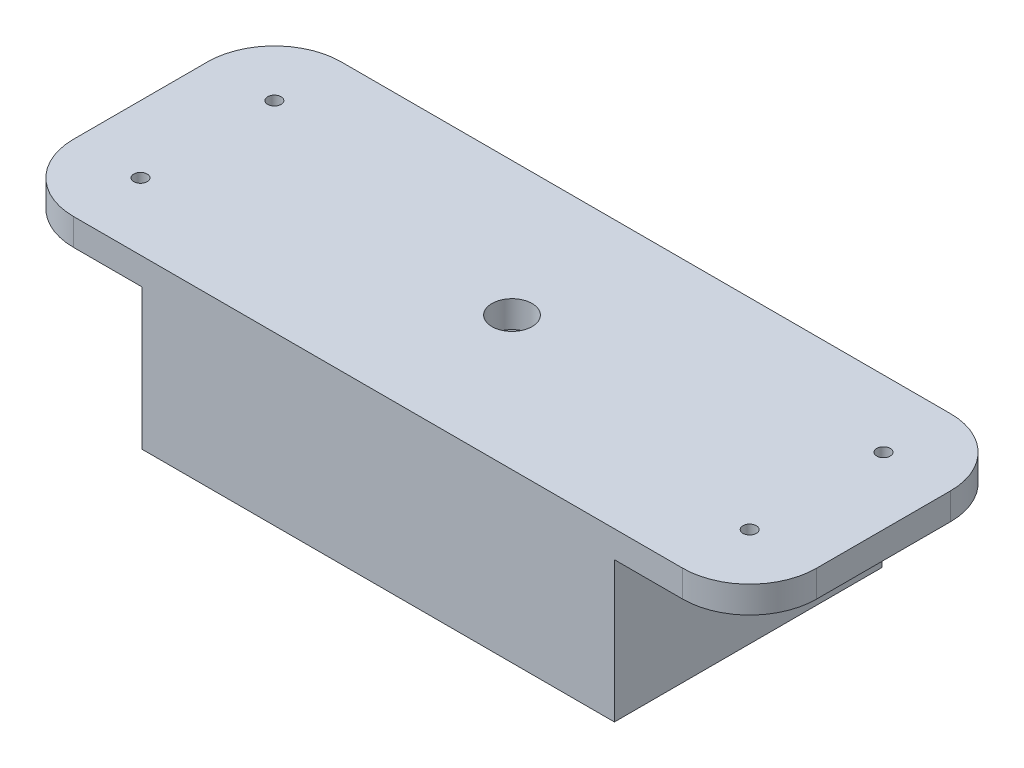
ISO-10303-21;
HEADER;
FILE_DESCRIPTION(('STEP AP214'),'2;1');
FILE_NAME('part.step','',(''),(''),'','','');
FILE_SCHEMA(('AUTOMOTIVE_DESIGN { 1 0 10303 214 1 1 1 1 }'));
ENDSEC;
DATA;
#1=APPLICATION_CONTEXT('core data for automotive mechanical design processes');
#2=APPLICATION_PROTOCOL_DEFINITION('international standard','automotive_design',2000,#1);
#3=PRODUCT_CONTEXT('',#1,'mechanical');
#4=PRODUCT('Part','Part','',(#3));
#5=PRODUCT_RELATED_PRODUCT_CATEGORY('part','',(#4));
#6=PRODUCT_DEFINITION_FORMATION('','',#4);
#7=PRODUCT_DEFINITION_CONTEXT('part definition',#1,'design');
#8=PRODUCT_DEFINITION('design','',#6,#7);
#9=PRODUCT_DEFINITION_SHAPE('','',#8);
#10=(LENGTH_UNIT() NAMED_UNIT(*) SI_UNIT(.MILLI.,.METRE.));
#11=(NAMED_UNIT(*) PLANE_ANGLE_UNIT() SI_UNIT($,.RADIAN.));
#12=(NAMED_UNIT(*) SI_UNIT($,.STERADIAN.) SOLID_ANGLE_UNIT());
#13=UNCERTAINTY_MEASURE_WITH_UNIT(LENGTH_MEASURE(1.E-05),#10,'distance_accuracy_value','');
#14=(GEOMETRIC_REPRESENTATION_CONTEXT(3) GLOBAL_UNCERTAINTY_ASSIGNED_CONTEXT((#13)) GLOBAL_UNIT_ASSIGNED_CONTEXT((#10,
#11,#12)) REPRESENTATION_CONTEXT('',''));
#15=CARTESIAN_POINT('',(0.,0.,0.));
#16=DIRECTION('',(0.,0.,1.));
#17=DIRECTION('',(1.,0.,0.));
#18=AXIS2_PLACEMENT_3D('',#15,#16,#17);
#19=CARTESIAN_POINT('',(0.,0.,0.));
#20=DIRECTION('',(0.,1.,0.));
#21=DIRECTION('',(0.,0.,1.));
#22=AXIS2_PLACEMENT_3D('',#19,#20,#21);
#23=PLANE('',#22);
#24=CARTESIAN_POINT('',(45.5,0.,-10.));
#25=DIRECTION('',(0.,1.,0.));
#26=DIRECTION('',(0.,0.,1.));
#27=AXIS2_PLACEMENT_3D('',#24,#25,#26);
#28=CIRCLE('',#27,0.999999999999998);
#29=CARTESIAN_POINT('',(45.5,0.,-9.));
#30=VERTEX_POINT('',#29);
#31=EDGE_CURVE('E247',#30,#30,#28,.T.);
#32=ORIENTED_EDGE('',*,*,#31,.T.);
#33=EDGE_LOOP('',(#32));
#34=FACE_BOUND('',#33,.T.);
#35=CARTESIAN_POINT('',(45.5,0.,10.));
#36=DIRECTION('',(0.,1.,0.));
#37=DIRECTION('',(0.,0.,1.));
#38=AXIS2_PLACEMENT_3D('',#35,#36,#37);
#39=CIRCLE('',#38,0.999999999999998);
#40=CARTESIAN_POINT('',(45.5,0.,11.));
#41=VERTEX_POINT('',#40);
#42=EDGE_CURVE('E199',#41,#41,#39,.T.);
#43=ORIENTED_EDGE('',*,*,#42,.T.);
#44=EDGE_LOOP('',(#43));
#45=FACE_BOUND('',#44,.T.);
#46=DIRECTION('',(0.,0.,1.));
#47=VECTOR('',#46,1.);
#48=CARTESIAN_POINT('',(35.3,0.,0.));
#49=LINE('',#48,#47);
#50=CARTESIAN_POINT('',(35.3,0.,-20.));
#51=VERTEX_POINT('',#50);
#52=CARTESIAN_POINT('',(35.3,0.,20.));
#53=VERTEX_POINT('',#52);
#54=EDGE_CURVE('E52',#51,#53,#49,.T.);
#55=ORIENTED_EDGE('',*,*,#54,.F.);
#56=DIRECTION('',(1.,0.,0.));
#57=VECTOR('',#56,1.);
#58=CARTESIAN_POINT('',(0.,0.,-20.));
#59=LINE('',#58,#57);
#60=CARTESIAN_POINT('',(45.4999999999999,0.,-20.));
#61=VERTEX_POINT('',#60);
#62=EDGE_CURVE('E253',#51,#61,#59,.T.);
#63=ORIENTED_EDGE('',*,*,#62,.T.);
#64=CARTESIAN_POINT('',(45.5,0.,-10.));
#65=DIRECTION('',(0.,1.,0.));
#66=DIRECTION('',(0.,0.,1.));
#67=AXIS2_PLACEMENT_3D('',#64,#65,#66);
#68=CIRCLE('',#67,10.);
#69=CARTESIAN_POINT('',(55.5,0.,-9.99999999999993));
#70=VERTEX_POINT('',#69);
#71=EDGE_CURVE('E250',#61,#70,#68,.F.);
#72=ORIENTED_EDGE('',*,*,#71,.T.);
#73=DIRECTION('',(0.,0.,1.));
#74=VECTOR('',#73,1.);
#75=CARTESIAN_POINT('',(55.5,0.,0.));
#76=LINE('',#75,#74);
#77=CARTESIAN_POINT('',(55.5,0.,9.99999999999993));
#78=VERTEX_POINT('',#77);
#79=EDGE_CURVE('E273',#70,#78,#76,.T.);
#80=ORIENTED_EDGE('',*,*,#79,.T.);
#81=CARTESIAN_POINT('',(45.5,0.,10.));
#82=DIRECTION('',(0.,1.,0.));
#83=DIRECTION('',(0.,0.,1.));
#84=AXIS2_PLACEMENT_3D('',#81,#82,#83);
#85=CIRCLE('',#84,10.);
#86=CARTESIAN_POINT('',(45.4999999999999,0.,20.));
#87=VERTEX_POINT('',#86);
#88=EDGE_CURVE('E270',#87,#78,#85,.T.);
#89=ORIENTED_EDGE('',*,*,#88,.F.);
#90=DIRECTION('',(1.,0.,0.));
#91=VECTOR('',#90,1.);
#92=CARTESIAN_POINT('',(0.,0.,20.));
#93=LINE('',#92,#91);
#94=EDGE_CURVE('E266',#53,#87,#93,.T.);
#95=ORIENTED_EDGE('',*,*,#94,.F.);
#96=EDGE_LOOP('',(#55,#63,#72,#80,#89,#95));
#97=FACE_BOUND('',#96,.T.);
#98=ADVANCED_FACE('F44',(#34,#45,#97),#23,.F.);
#99=CARTESIAN_POINT('',(0.,0.,0.));
#100=DIRECTION('',(0.,1.,0.));
#101=DIRECTION('',(0.,0.,1.));
#102=AXIS2_PLACEMENT_3D('',#99,#100,#101);
#103=CIRCLE('',#102,3.);
#104=CARTESIAN_POINT('',(0.,0.,3.));
#105=VERTEX_POINT('',#104);
#106=EDGE_CURVE('E174',#105,#105,#103,.T.);
#107=ORIENTED_EDGE('',*,*,#106,.T.);
#108=EDGE_LOOP('',(#107));
#109=FACE_BOUND('',#108,.T.);
#110=DIRECTION('',(0.,0.,1.));
#111=VECTOR('',#110,1.);
#112=CARTESIAN_POINT('',(-33.8,0.,1.01420373600893E-13));
#113=LINE('',#112,#111);
#114=CARTESIAN_POINT('',(-33.8,0.,-18.5));
#115=VERTEX_POINT('',#114);
#116=CARTESIAN_POINT('',(-33.8,0.,18.5));
#117=VERTEX_POINT('',#116);
#118=EDGE_CURVE('E307',#115,#117,#113,.T.);
#119=ORIENTED_EDGE('',*,*,#118,.F.);
#120=DIRECTION('',(1.,0.,0.));
#121=VECTOR('',#120,1.);
#122=CARTESIAN_POINT('',(0.,0.,-18.5));
#123=LINE('',#122,#121);
#124=CARTESIAN_POINT('',(33.8,0.,-18.5));
#125=VERTEX_POINT('',#124);
#126=EDGE_CURVE('E162',#115,#125,#123,.T.);
#127=ORIENTED_EDGE('',*,*,#126,.T.);
#128=DIRECTION('',(0.,0.,1.));
#129=VECTOR('',#128,1.);
#130=CARTESIAN_POINT('',(33.8,0.,0.));
#131=LINE('',#130,#129);
#132=CARTESIAN_POINT('',(33.8,0.,18.5));
#133=VERTEX_POINT('',#132);
#134=EDGE_CURVE('E302',#125,#133,#131,.T.);
#135=ORIENTED_EDGE('',*,*,#134,.T.);
#136=DIRECTION('',(1.,0.,0.));
#137=VECTOR('',#136,1.);
#138=CARTESIAN_POINT('',(0.,0.,18.5));
#139=LINE('',#138,#137);
#140=EDGE_CURVE('E305',#117,#133,#139,.T.);
#141=ORIENTED_EDGE('',*,*,#140,.F.);
#142=EDGE_LOOP('',(#119,#127,#135,#141));
#143=FACE_BOUND('',#142,.T.);
#144=ADVANCED_FACE('F356',(#109,#143),#23,.F.);
#145=CARTESIAN_POINT('',(45.5,4.,-10.));
#146=DIRECTION('',(0.,-1.,0.));
#147=DIRECTION('',(0.,0.,-1.));
#148=AXIS2_PLACEMENT_3D('',#145,#146,#147);
#149=CYLINDRICAL_SURFACE('',#148,10.);
#150=ORIENTED_EDGE('',*,*,#71,.F.);
#151=DIRECTION('',(0.,-1.,0.));
#152=VECTOR('',#151,1.);
#153=CARTESIAN_POINT('',(45.4999999999999,4.,-20.));
#154=LINE('',#153,#152);
#155=CARTESIAN_POINT('',(45.4999999999999,4.,-20.));
#156=VERTEX_POINT('',#155);
#157=EDGE_CURVE('E298',#156,#61,#154,.T.);
#158=ORIENTED_EDGE('',*,*,#157,.F.);
#159=CARTESIAN_POINT('',(45.5,4.,-10.));
#160=DIRECTION('',(0.,1.,0.));
#161=DIRECTION('',(0.,0.,1.));
#162=AXIS2_PLACEMENT_3D('',#159,#160,#161);
#163=CIRCLE('',#162,10.);
#164=CARTESIAN_POINT('',(55.5,4.,-9.99999999999993));
#165=VERTEX_POINT('',#164);
#166=EDGE_CURVE('E217',#156,#165,#163,.F.);
#167=ORIENTED_EDGE('',*,*,#166,.T.);
#168=DIRECTION('',(0.,-1.,0.));
#169=VECTOR('',#168,1.);
#170=CARTESIAN_POINT('',(55.5,4.,-9.99999999999993));
#171=LINE('',#170,#169);
#172=EDGE_CURVE('E244',#165,#70,#171,.T.);
#173=ORIENTED_EDGE('',*,*,#172,.T.);
#174=EDGE_LOOP('',(#150,#158,#167,#173));
#175=FACE_BOUND('',#174,.T.);
#176=ADVANCED_FACE('F362',(#175),#149,.T.);
#177=CARTESIAN_POINT('',(0.,4.,-20.));
#178=DIRECTION('',(0.,0.,-1.));
#179=DIRECTION('',(-1.,0.,0.));
#180=AXIS2_PLACEMENT_3D('',#177,#178,#179);
#181=PLANE('',#180);
#182=DIRECTION('',(1.,0.,0.));
#183=VECTOR('',#182,1.);
#184=CARTESIAN_POINT('',(0.,4.,-20.));
#185=LINE('',#184,#183);
#186=CARTESIAN_POINT('',(-45.4999999999999,4.,-20.));
#187=VERTEX_POINT('',#186);
#188=EDGE_CURVE('E220',#187,#156,#185,.T.);
#189=ORIENTED_EDGE('',*,*,#188,.T.);
#190=ORIENTED_EDGE('',*,*,#157,.T.);
#191=ORIENTED_EDGE('',*,*,#62,.F.);
#192=DIRECTION('',(0.,1.,0.));
#193=VECTOR('',#192,1.);
#194=CARTESIAN_POINT('',(35.3,-21.,-20.));
#195=LINE('',#194,#193);
#196=CARTESIAN_POINT('',(35.3,-21.,-20.));
#197=VERTEX_POINT('',#196);
#198=EDGE_CURVE('E200',#197,#51,#195,.T.);
#199=ORIENTED_EDGE('',*,*,#198,.F.);
#200=DIRECTION('',(-1.,0.,0.));
#201=VECTOR('',#200,1.);
#202=CARTESIAN_POINT('',(0.,-21.,-20.));
#203=LINE('',#202,#201);
#204=CARTESIAN_POINT('',(-35.3,-21.,-20.));
#205=VERTEX_POINT('',#204);
#206=EDGE_CURVE('E165',#197,#205,#203,.T.);
#207=ORIENTED_EDGE('',*,*,#206,.T.);
#208=DIRECTION('',(0.,1.,0.));
#209=VECTOR('',#208,1.);
#210=CARTESIAN_POINT('',(-35.3,-21.,-20.));
#211=LINE('',#210,#209);
#212=CARTESIAN_POINT('',(-35.3,0.,-20.));
#213=VERTEX_POINT('',#212);
#214=EDGE_CURVE('E196',#205,#213,#211,.T.);
#215=ORIENTED_EDGE('',*,*,#214,.T.);
#216=CARTESIAN_POINT('',(-45.4999999999999,0.,-20.));
#217=VERTEX_POINT('',#216);
#218=EDGE_CURVE('E254',#217,#213,#59,.T.);
#219=ORIENTED_EDGE('',*,*,#218,.F.);
#220=DIRECTION('',(0.,-1.,0.));
#221=VECTOR('',#220,1.);
#222=CARTESIAN_POINT('',(-45.4999999999999,4.,-20.));
#223=LINE('',#222,#221);
#224=EDGE_CURVE('E296',#187,#217,#223,.T.);
#225=ORIENTED_EDGE('',*,*,#224,.F.);
#226=EDGE_LOOP('',(#189,#190,#191,#199,#207,#215,#219,#225));
#227=FACE_BOUND('',#226,.T.);
#228=ADVANCED_FACE('F341',(#227),#181,.T.);
#229=CARTESIAN_POINT('',(-45.5,4.,-10.));
#230=DIRECTION('',(0.,-1.,0.));
#231=DIRECTION('',(0.,0.,-1.));
#232=AXIS2_PLACEMENT_3D('',#229,#230,#231);
#233=CYLINDRICAL_SURFACE('',#232,10.);
#234=CARTESIAN_POINT('',(-45.5,0.,-10.));
#235=DIRECTION('',(0.,1.,0.));
#236=DIRECTION('',(0.,0.,1.));
#237=AXIS2_PLACEMENT_3D('',#234,#235,#236);
#238=CIRCLE('',#237,10.);
#239=CARTESIAN_POINT('',(-55.5,0.,-9.99999999999993));
#240=VERTEX_POINT('',#239);
#241=EDGE_CURVE('E257',#217,#240,#238,.T.);
#242=ORIENTED_EDGE('',*,*,#241,.T.);
#243=DIRECTION('',(0.,-1.,0.));
#244=VECTOR('',#243,1.);
#245=CARTESIAN_POINT('',(-55.5,4.,-9.99999999999993));
#246=LINE('',#245,#244);
#247=CARTESIAN_POINT('',(-55.5,4.,-9.99999999999993));
#248=VERTEX_POINT('',#247);
#249=EDGE_CURVE('E293',#248,#240,#246,.T.);
#250=ORIENTED_EDGE('',*,*,#249,.F.);
#251=CARTESIAN_POINT('',(-45.5,4.,-10.));
#252=DIRECTION('',(0.,1.,0.));
#253=DIRECTION('',(0.,0.,1.));
#254=AXIS2_PLACEMENT_3D('',#251,#252,#253);
#255=CIRCLE('',#254,10.);
#256=EDGE_CURVE('E222',#187,#248,#255,.T.);
#257=ORIENTED_EDGE('',*,*,#256,.F.);
#258=ORIENTED_EDGE('',*,*,#224,.T.);
#259=EDGE_LOOP('',(#242,#250,#257,#258));
#260=FACE_BOUND('',#259,.T.);
#261=ADVANCED_FACE('F462',(#260),#233,.T.);
#262=CARTESIAN_POINT('',(-55.5,4.,0.));
#263=DIRECTION('',(1.,0.,0.));
#264=DIRECTION('',(0.,0.,-1.));
#265=AXIS2_PLACEMENT_3D('',#262,#263,#264);
#266=PLANE('',#265);
#267=DIRECTION('',(0.,0.,1.));
#268=VECTOR('',#267,1.);
#269=CARTESIAN_POINT('',(-55.5,0.,0.));
#270=LINE('',#269,#268);
#271=CARTESIAN_POINT('',(-55.5,0.,9.99999999999993));
#272=VERTEX_POINT('',#271);
#273=EDGE_CURVE('E260',#240,#272,#270,.T.);
#274=ORIENTED_EDGE('',*,*,#273,.T.);
#275=DIRECTION('',(0.,-1.,0.));
#276=VECTOR('',#275,1.);
#277=CARTESIAN_POINT('',(-55.5,4.,9.99999999999993));
#278=LINE('',#277,#276);
#279=CARTESIAN_POINT('',(-55.5,4.,9.99999999999993));
#280=VERTEX_POINT('',#279);
#281=EDGE_CURVE('E290',#280,#272,#278,.T.);
#282=ORIENTED_EDGE('',*,*,#281,.F.);
#283=DIRECTION('',(0.,0.,1.));
#284=VECTOR('',#283,1.);
#285=CARTESIAN_POINT('',(-55.5,4.,0.));
#286=LINE('',#285,#284);
#287=EDGE_CURVE('E225',#248,#280,#286,.T.);
#288=ORIENTED_EDGE('',*,*,#287,.F.);
#289=ORIENTED_EDGE('',*,*,#249,.T.);
#290=EDGE_LOOP('',(#274,#282,#288,#289));
#291=FACE_BOUND('',#290,.T.);
#292=ADVANCED_FACE('F471',(#291),#266,.F.);
#293=CARTESIAN_POINT('',(-45.5,4.,10.));
#294=DIRECTION('',(0.,-1.,0.));
#295=DIRECTION('',(0.,0.,-1.));
#296=AXIS2_PLACEMENT_3D('',#293,#294,#295);
#297=CYLINDRICAL_SURFACE('',#296,10.);
#298=CARTESIAN_POINT('',(-45.5,0.,10.));
#299=DIRECTION('',(0.,1.,0.));
#300=DIRECTION('',(0.,0.,1.));
#301=AXIS2_PLACEMENT_3D('',#298,#299,#300);
#302=CIRCLE('',#301,10.);
#303=CARTESIAN_POINT('',(-45.4999999999999,0.,20.));
#304=VERTEX_POINT('',#303);
#305=EDGE_CURVE('E263',#272,#304,#302,.T.);
#306=ORIENTED_EDGE('',*,*,#305,.T.);
#307=DIRECTION('',(0.,-1.,0.));
#308=VECTOR('',#307,1.);
#309=CARTESIAN_POINT('',(-45.4999999999999,4.,20.));
#310=LINE('',#309,#308);
#311=CARTESIAN_POINT('',(-45.4999999999999,4.,20.));
#312=VERTEX_POINT('',#311);
#313=EDGE_CURVE('E287',#312,#304,#310,.T.);
#314=ORIENTED_EDGE('',*,*,#313,.F.);
#315=CARTESIAN_POINT('',(-45.5,4.,10.));
#316=DIRECTION('',(0.,1.,0.));
#317=DIRECTION('',(0.,0.,1.));
#318=AXIS2_PLACEMENT_3D('',#315,#316,#317);
#319=CIRCLE('',#318,10.);
#320=EDGE_CURVE('E228',#280,#312,#319,.T.);
#321=ORIENTED_EDGE('',*,*,#320,.F.);
#322=ORIENTED_EDGE('',*,*,#281,.T.);
#323=EDGE_LOOP('',(#306,#314,#321,#322));
#324=FACE_BOUND('',#323,.T.);
#325=ADVANCED_FACE('F330',(#324),#297,.T.);
#326=CARTESIAN_POINT('',(0.,4.,20.));
#327=DIRECTION('',(0.,0.,-1.));
#328=DIRECTION('',(-1.,0.,0.));
#329=AXIS2_PLACEMENT_3D('',#326,#327,#328);
#330=PLANE('',#329);
#331=CARTESIAN_POINT('',(-35.3,0.,20.));
#332=VERTEX_POINT('',#331);
#333=EDGE_CURVE('E267',#304,#332,#93,.T.);
#334=ORIENTED_EDGE('',*,*,#333,.T.);
#335=DIRECTION('',(0.,1.,0.));
#336=VECTOR('',#335,1.);
#337=CARTESIAN_POINT('',(-35.3,-21.,20.));
#338=LINE('',#337,#336);
#339=CARTESIAN_POINT('',(-35.3,-21.,20.));
#340=VERTEX_POINT('',#339);
#341=EDGE_CURVE('E203',#340,#332,#338,.T.);
#342=ORIENTED_EDGE('',*,*,#341,.F.);
#343=DIRECTION('',(1.,0.,0.));
#344=VECTOR('',#343,1.);
#345=CARTESIAN_POINT('',(0.,-21.,20.));
#346=LINE('',#345,#344);
#347=CARTESIAN_POINT('',(35.3,-21.,20.));
#348=VERTEX_POINT('',#347);
#349=EDGE_CURVE('E190',#340,#348,#346,.T.);
#350=ORIENTED_EDGE('',*,*,#349,.T.);
#351=DIRECTION('',(0.,1.,0.));
#352=VECTOR('',#351,1.);
#353=CARTESIAN_POINT('',(35.3,-21.,20.));
#354=LINE('',#353,#352);
#355=EDGE_CURVE('E67',#348,#53,#354,.T.);
#356=ORIENTED_EDGE('',*,*,#355,.T.);
#357=ORIENTED_EDGE('',*,*,#94,.T.);
#358=DIRECTION('',(0.,-1.,0.));
#359=VECTOR('',#358,1.);
#360=CARTESIAN_POINT('',(45.4999999999999,4.,20.));
#361=LINE('',#360,#359);
#362=CARTESIAN_POINT('',(45.4999999999999,4.,20.));
#363=VERTEX_POINT('',#362);
#364=EDGE_CURVE('E284',#363,#87,#361,.T.);
#365=ORIENTED_EDGE('',*,*,#364,.F.);
#366=DIRECTION('',(1.,0.,0.));
#367=VECTOR('',#366,1.);
#368=CARTESIAN_POINT('',(0.,4.,20.));
#369=LINE('',#368,#367);
#370=EDGE_CURVE('E231',#312,#363,#369,.T.);
#371=ORIENTED_EDGE('',*,*,#370,.F.);
#372=ORIENTED_EDGE('',*,*,#313,.T.);
#373=EDGE_LOOP('',(#334,#342,#350,#356,#357,#365,#371,#372));
#374=FACE_BOUND('',#373,.T.);
#375=ADVANCED_FACE('F317',(#374),#330,.F.);
#376=CARTESIAN_POINT('',(45.5,4.,10.));
#377=DIRECTION('',(0.,-1.,0.));
#378=DIRECTION('',(0.,0.,-1.));
#379=AXIS2_PLACEMENT_3D('',#376,#377,#378);
#380=CYLINDRICAL_SURFACE('',#379,10.);
#381=ORIENTED_EDGE('',*,*,#88,.T.);
#382=DIRECTION('',(0.,-1.,0.));
#383=VECTOR('',#382,1.);
#384=CARTESIAN_POINT('',(55.5,4.,9.99999999999993));
#385=LINE('',#384,#383);
#386=CARTESIAN_POINT('',(55.5,4.,9.99999999999993));
#387=VERTEX_POINT('',#386);
#388=EDGE_CURVE('E282',#387,#78,#385,.T.);
#389=ORIENTED_EDGE('',*,*,#388,.F.);
#390=CARTESIAN_POINT('',(45.5,4.,10.));
#391=DIRECTION('',(0.,1.,0.));
#392=DIRECTION('',(0.,0.,1.));
#393=AXIS2_PLACEMENT_3D('',#390,#391,#392);
#394=CIRCLE('',#393,10.);
#395=EDGE_CURVE('E233',#363,#387,#394,.T.);
#396=ORIENTED_EDGE('',*,*,#395,.F.);
#397=ORIENTED_EDGE('',*,*,#364,.T.);
#398=EDGE_LOOP('',(#381,#389,#396,#397));
#399=FACE_BOUND('',#398,.T.);
#400=ADVANCED_FACE('F320',(#399),#380,.T.);
#401=CARTESIAN_POINT('',(-45.5,4.,10.));
#402=DIRECTION('',(0.,-1.,0.));
#403=DIRECTION('',(0.,0.,-1.));
#404=AXIS2_PLACEMENT_3D('',#401,#402,#403);
#405=CYLINDRICAL_SURFACE('',#404,0.999999999999998);
#406=CARTESIAN_POINT('',(-45.5,4.,10.));
#407=DIRECTION('',(0.,1.,0.));
#408=DIRECTION('',(0.,0.,1.));
#409=AXIS2_PLACEMENT_3D('',#406,#407,#408);
#410=CIRCLE('',#409,0.999999999999998);
#411=CARTESIAN_POINT('',(-45.5,4.,11.));
#412=VERTEX_POINT('',#411);
#413=EDGE_CURVE('E238',#412,#412,#410,.T.);
#414=ORIENTED_EDGE('',*,*,#413,.T.);
#415=EDGE_LOOP('',(#414));
#416=FACE_BOUND('',#415,.T.);
#417=CARTESIAN_POINT('',(-45.5,0.,10.));
#418=DIRECTION('',(0.,1.,0.));
#419=DIRECTION('',(0.,0.,1.));
#420=AXIS2_PLACEMENT_3D('',#417,#418,#419);
#421=CIRCLE('',#420,0.999999999999998);
#422=CARTESIAN_POINT('',(-45.5,0.,11.));
#423=VERTEX_POINT('',#422);
#424=EDGE_CURVE('E276',#423,#423,#421,.T.);
#425=ORIENTED_EDGE('',*,*,#424,.F.);
#426=EDGE_LOOP('',(#425));
#427=FACE_BOUND('',#426,.T.);
#428=ADVANCED_FACE('F506',(#416,#427),#405,.F.);
#429=CARTESIAN_POINT('',(55.5,4.,0.));
#430=DIRECTION('',(1.,0.,0.));
#431=DIRECTION('',(0.,0.,-1.));
#432=AXIS2_PLACEMENT_3D('',#429,#430,#431);
#433=PLANE('',#432);
#434=ORIENTED_EDGE('',*,*,#79,.F.);
#435=ORIENTED_EDGE('',*,*,#172,.F.);
#436=DIRECTION('',(0.,0.,1.));
#437=VECTOR('',#436,1.);
#438=CARTESIAN_POINT('',(55.5,4.,0.));
#439=LINE('',#438,#437);
#440=EDGE_CURVE('E235',#165,#387,#439,.T.);
#441=ORIENTED_EDGE('',*,*,#440,.T.);
#442=ORIENTED_EDGE('',*,*,#388,.T.);
#443=EDGE_LOOP('',(#434,#435,#441,#442));
#444=FACE_BOUND('',#443,.T.);
#445=ADVANCED_FACE('F515',(#444),#433,.T.);
#446=CARTESIAN_POINT('',(45.5,4.,-10.));
#447=DIRECTION('',(0.,-1.,0.));
#448=DIRECTION('',(0.,0.,-1.));
#449=AXIS2_PLACEMENT_3D('',#446,#447,#448);
#450=CYLINDRICAL_SURFACE('',#449,0.999999999999998);
#451=CARTESIAN_POINT('',(45.5,4.,-10.));
#452=DIRECTION('',(0.,1.,0.));
#453=DIRECTION('',(0.,0.,1.));
#454=AXIS2_PLACEMENT_3D('',#451,#452,#453);
#455=CIRCLE('',#454,0.999999999999998);
#456=CARTESIAN_POINT('',(45.5,4.,-9.));
#457=VERTEX_POINT('',#456);
#458=EDGE_CURVE('E213',#457,#457,#455,.T.);
#459=ORIENTED_EDGE('',*,*,#458,.T.);
#460=EDGE_LOOP('',(#459));
#461=FACE_BOUND('',#460,.T.);
#462=ORIENTED_EDGE('',*,*,#31,.F.);
#463=EDGE_LOOP('',(#462));
#464=FACE_BOUND('',#463,.T.);
#465=ADVANCED_FACE('F525',(#461,#464),#450,.F.);
#466=CARTESIAN_POINT('',(45.5,4.,10.));
#467=DIRECTION('',(0.,-1.,0.));
#468=DIRECTION('',(0.,0.,-1.));
#469=AXIS2_PLACEMENT_3D('',#466,#467,#468);
#470=CYLINDRICAL_SURFACE('',#469,0.999999999999998);
#471=CARTESIAN_POINT('',(45.5,4.,10.));
#472=DIRECTION('',(0.,1.,0.));
#473=DIRECTION('',(0.,0.,1.));
#474=AXIS2_PLACEMENT_3D('',#471,#472,#473);
#475=CIRCLE('',#474,0.999999999999998);
#476=CARTESIAN_POINT('',(45.5,4.,11.));
#477=VERTEX_POINT('',#476);
#478=EDGE_CURVE('E210',#477,#477,#475,.T.);
#479=ORIENTED_EDGE('',*,*,#478,.T.);
#480=EDGE_LOOP('',(#479));
#481=FACE_BOUND('',#480,.T.);
#482=ORIENTED_EDGE('',*,*,#42,.F.);
#483=EDGE_LOOP('',(#482));
#484=FACE_BOUND('',#483,.T.);
#485=ADVANCED_FACE('F46',(#481,#484),#470,.F.);
#486=CARTESIAN_POINT('',(-45.5,4.,-10.));
#487=DIRECTION('',(0.,-1.,0.));
#488=DIRECTION('',(0.,0.,-1.));
#489=AXIS2_PLACEMENT_3D('',#486,#487,#488);
#490=CYLINDRICAL_SURFACE('',#489,0.999999999999998);
#491=CARTESIAN_POINT('',(-45.5,4.,-10.));
#492=DIRECTION('',(0.,1.,0.));
#493=DIRECTION('',(0.,0.,1.));
#494=AXIS2_PLACEMENT_3D('',#491,#492,#493);
#495=CIRCLE('',#494,0.999999999999998);
#496=CARTESIAN_POINT('',(-45.5,4.,-9.00000000000001));
#497=VERTEX_POINT('',#496);
#498=EDGE_CURVE('E241',#497,#497,#495,.T.);
#499=ORIENTED_EDGE('',*,*,#498,.T.);
#500=EDGE_LOOP('',(#499));
#501=FACE_BOUND('',#500,.T.);
#502=CARTESIAN_POINT('',(-45.5,0.,-10.));
#503=DIRECTION('',(0.,1.,0.));
#504=DIRECTION('',(0.,0.,1.));
#505=AXIS2_PLACEMENT_3D('',#502,#503,#504);
#506=CIRCLE('',#505,0.999999999999998);
#507=CARTESIAN_POINT('',(-45.5,0.,-9.00000000000001));
#508=VERTEX_POINT('',#507);
#509=EDGE_CURVE('E214',#508,#508,#506,.T.);
#510=ORIENTED_EDGE('',*,*,#509,.F.);
#511=EDGE_LOOP('',(#510));
#512=FACE_BOUND('',#511,.T.);
#513=ADVANCED_FACE('F373',(#501,#512),#490,.F.);
#514=CARTESIAN_POINT('',(0.,4.,0.));
#515=DIRECTION('',(0.,1.,0.));
#516=DIRECTION('',(0.,0.,1.));
#517=AXIS2_PLACEMENT_3D('',#514,#515,#516);
#518=PLANE('',#517);
#519=CARTESIAN_POINT('',(0.,4.,0.));
#520=DIRECTION('',(0.,1.,0.));
#521=DIRECTION('',(0.,0.,1.));
#522=AXIS2_PLACEMENT_3D('',#519,#520,#521);
#523=CIRCLE('',#522,3.);
#524=CARTESIAN_POINT('',(0.,4.,3.));
#525=VERTEX_POINT('',#524);
#526=EDGE_CURVE('E671',#525,#525,#523,.T.);
#527=ORIENTED_EDGE('',*,*,#526,.F.);
#528=EDGE_LOOP('',(#527));
#529=FACE_BOUND('',#528,.T.);
#530=ORIENTED_EDGE('',*,*,#370,.T.);
#531=ORIENTED_EDGE('',*,*,#395,.T.);
#532=ORIENTED_EDGE('',*,*,#440,.F.);
#533=ORIENTED_EDGE('',*,*,#166,.F.);
#534=ORIENTED_EDGE('',*,*,#188,.F.);
#535=ORIENTED_EDGE('',*,*,#256,.T.);
#536=ORIENTED_EDGE('',*,*,#287,.T.);
#537=ORIENTED_EDGE('',*,*,#320,.T.);
#538=EDGE_LOOP('',(#530,#531,#532,#533,#534,#535,#536,#537));
#539=FACE_BOUND('',#538,.T.);
#540=ORIENTED_EDGE('',*,*,#413,.F.);
#541=EDGE_LOOP('',(#540));
#542=FACE_BOUND('',#541,.T.);
#543=ORIENTED_EDGE('',*,*,#498,.F.);
#544=EDGE_LOOP('',(#543));
#545=FACE_BOUND('',#544,.T.);
#546=ORIENTED_EDGE('',*,*,#458,.F.);
#547=EDGE_LOOP('',(#546));
#548=FACE_BOUND('',#547,.T.);
#549=ORIENTED_EDGE('',*,*,#478,.F.);
#550=EDGE_LOOP('',(#549));
#551=FACE_BOUND('',#550,.T.);
#552=ADVANCED_FACE('F324',(#529,#539,#542,#545,#548,#551),#518,.T.);
#553=ORIENTED_EDGE('',*,*,#218,.T.);
#554=DIRECTION('',(0.,0.,1.));
#555=VECTOR('',#554,1.);
#556=CARTESIAN_POINT('',(-35.3,0.,0.));
#557=LINE('',#556,#555);
#558=EDGE_CURVE('E11',#213,#332,#557,.T.);
#559=ORIENTED_EDGE('',*,*,#558,.T.);
#560=ORIENTED_EDGE('',*,*,#333,.F.);
#561=ORIENTED_EDGE('',*,*,#305,.F.);
#562=ORIENTED_EDGE('',*,*,#273,.F.);
#563=ORIENTED_EDGE('',*,*,#241,.F.);
#564=EDGE_LOOP('',(#553,#559,#560,#561,#562,#563));
#565=FACE_BOUND('',#564,.T.);
#566=ORIENTED_EDGE('',*,*,#424,.T.);
#567=EDGE_LOOP('',(#566));
#568=FACE_BOUND('',#567,.T.);
#569=ORIENTED_EDGE('',*,*,#509,.T.);
#570=EDGE_LOOP('',(#569));
#571=FACE_BOUND('',#570,.T.);
#572=ADVANCED_FACE('F333',(#565,#568,#571),#23,.F.);
#573=CARTESIAN_POINT('',(-35.3,-21.,0.));
#574=DIRECTION('',(-1.,0.,0.));
#575=DIRECTION('',(0.,0.,1.));
#576=AXIS2_PLACEMENT_3D('',#573,#574,#575);
#577=PLANE('',#576);
#578=ORIENTED_EDGE('',*,*,#558,.F.);
#579=ORIENTED_EDGE('',*,*,#214,.F.);
#580=DIRECTION('',(0.,0.,1.));
#581=VECTOR('',#580,1.);
#582=CARTESIAN_POINT('',(-35.3,-21.,0.));
#583=LINE('',#582,#581);
#584=EDGE_CURVE('E187',#205,#340,#583,.T.);
#585=ORIENTED_EDGE('',*,*,#584,.T.);
#586=ORIENTED_EDGE('',*,*,#341,.T.);
#587=EDGE_LOOP('',(#578,#579,#585,#586));
#588=FACE_BOUND('',#587,.T.);
#589=ADVANCED_FACE('F338',(#588),#577,.T.);
#590=CARTESIAN_POINT('',(35.3,-21.,0.));
#591=DIRECTION('',(-1.,0.,0.));
#592=DIRECTION('',(0.,0.,1.));
#593=AXIS2_PLACEMENT_3D('',#590,#591,#592);
#594=PLANE('',#593);
#595=ORIENTED_EDGE('',*,*,#198,.T.);
#596=ORIENTED_EDGE('',*,*,#54,.T.);
#597=ORIENTED_EDGE('',*,*,#355,.F.);
#598=DIRECTION('',(0.,0.,1.));
#599=VECTOR('',#598,1.);
#600=CARTESIAN_POINT('',(35.3,-21.,0.));
#601=LINE('',#600,#599);
#602=EDGE_CURVE('E192',#197,#348,#601,.T.);
#603=ORIENTED_EDGE('',*,*,#602,.F.);
#604=EDGE_LOOP('',(#595,#596,#597,#603));
#605=FACE_BOUND('',#604,.T.);
#606=ADVANCED_FACE('F311',(#605),#594,.F.);
#607=CARTESIAN_POINT('',(-33.8,-21.,1.01420373600893E-13));
#608=DIRECTION('',(-1.,0.,0.));
#609=DIRECTION('',(0.,0.,1.));
#610=AXIS2_PLACEMENT_3D('',#607,#608,#609);
#611=PLANE('',#610);
#612=DIRECTION('',(0.,1.,0.));
#613=VECTOR('',#612,1.);
#614=CARTESIAN_POINT('',(-33.8,-21.,-18.5));
#615=LINE('',#614,#613);
#616=CARTESIAN_POINT('',(-33.8,-21.,-18.5));
#617=VERTEX_POINT('',#616);
#618=EDGE_CURVE('E156',#617,#115,#615,.T.);
#619=ORIENTED_EDGE('',*,*,#618,.T.);
#620=ORIENTED_EDGE('',*,*,#118,.T.);
#621=DIRECTION('',(0.,1.,0.));
#622=VECTOR('',#621,1.);
#623=CARTESIAN_POINT('',(-33.8,-21.,18.5));
#624=LINE('',#623,#622);
#625=CARTESIAN_POINT('',(-33.8,-21.,18.5));
#626=VERTEX_POINT('',#625);
#627=EDGE_CURVE('E172',#626,#117,#624,.T.);
#628=ORIENTED_EDGE('',*,*,#627,.F.);
#629=DIRECTION('',(0.,0.,1.));
#630=VECTOR('',#629,1.);
#631=CARTESIAN_POINT('',(-33.8,-21.,1.01420373600893E-13));
#632=LINE('',#631,#630);
#633=EDGE_CURVE('E169',#617,#626,#632,.T.);
#634=ORIENTED_EDGE('',*,*,#633,.F.);
#635=EDGE_LOOP('',(#619,#620,#628,#634));
#636=FACE_BOUND('',#635,.T.);
#637=ADVANCED_FACE('F170',(#636),#611,.F.);
#638=CARTESIAN_POINT('',(0.,-21.,18.5));
#639=DIRECTION('',(0.,0.,1.));
#640=DIRECTION('',(1.,0.,0.));
#641=AXIS2_PLACEMENT_3D('',#638,#639,#640);
#642=PLANE('',#641);
#643=ORIENTED_EDGE('',*,*,#627,.T.);
#644=ORIENTED_EDGE('',*,*,#140,.T.);
#645=DIRECTION('',(0.,1.,0.));
#646=VECTOR('',#645,1.);
#647=CARTESIAN_POINT('',(33.8,-21.,18.5));
#648=LINE('',#647,#646);
#649=CARTESIAN_POINT('',(33.8,-21.,18.5));
#650=VERTEX_POINT('',#649);
#651=EDGE_CURVE('E206',#650,#133,#648,.T.);
#652=ORIENTED_EDGE('',*,*,#651,.F.);
#653=DIRECTION('',(1.,0.,0.));
#654=VECTOR('',#653,1.);
#655=CARTESIAN_POINT('',(0.,-21.,18.5));
#656=LINE('',#655,#654);
#657=EDGE_CURVE('E182',#626,#650,#656,.T.);
#658=ORIENTED_EDGE('',*,*,#657,.F.);
#659=EDGE_LOOP('',(#643,#644,#652,#658));
#660=FACE_BOUND('',#659,.T.);
#661=ADVANCED_FACE('F382',(#660),#642,.F.);
#662=CARTESIAN_POINT('',(33.8,-21.,0.));
#663=DIRECTION('',(-1.,0.,0.));
#664=DIRECTION('',(0.,0.,1.));
#665=AXIS2_PLACEMENT_3D('',#662,#663,#664);
#666=PLANE('',#665);
#667=ORIENTED_EDGE('',*,*,#134,.F.);
#668=DIRECTION('',(0.,1.,0.));
#669=VECTOR('',#668,1.);
#670=CARTESIAN_POINT('',(33.8,-21.,-18.5));
#671=LINE('',#670,#669);
#672=CARTESIAN_POINT('',(33.8,-21.,-18.5));
#673=VERTEX_POINT('',#672);
#674=EDGE_CURVE('E59',#673,#125,#671,.T.);
#675=ORIENTED_EDGE('',*,*,#674,.F.);
#676=DIRECTION('',(0.,0.,1.));
#677=VECTOR('',#676,1.);
#678=CARTESIAN_POINT('',(33.8,-21.,0.));
#679=LINE('',#678,#677);
#680=EDGE_CURVE('E180',#673,#650,#679,.T.);
#681=ORIENTED_EDGE('',*,*,#680,.T.);
#682=ORIENTED_EDGE('',*,*,#651,.T.);
#683=EDGE_LOOP('',(#667,#675,#681,#682));
#684=FACE_BOUND('',#683,.T.);
#685=ADVANCED_FACE('F352',(#684),#666,.T.);
#686=CARTESIAN_POINT('',(0.,-21.,-18.5));
#687=DIRECTION('',(0.,0.,1.));
#688=DIRECTION('',(1.,0.,0.));
#689=AXIS2_PLACEMENT_3D('',#686,#687,#688);
#690=PLANE('',#689);
#691=ORIENTED_EDGE('',*,*,#126,.F.);
#692=ORIENTED_EDGE('',*,*,#618,.F.);
#693=DIRECTION('',(1.,0.,0.));
#694=VECTOR('',#693,1.);
#695=CARTESIAN_POINT('',(0.,-21.,-18.5));
#696=LINE('',#695,#694);
#697=EDGE_CURVE('E160',#617,#673,#696,.T.);
#698=ORIENTED_EDGE('',*,*,#697,.T.);
#699=ORIENTED_EDGE('',*,*,#674,.T.);
#700=EDGE_LOOP('',(#691,#692,#698,#699));
#701=FACE_BOUND('',#700,.T.);
#702=ADVANCED_FACE('F158',(#701),#690,.T.);
#703=CARTESIAN_POINT('',(0.,-21.,0.));
#704=DIRECTION('',(0.,1.,0.));
#705=DIRECTION('',(0.,0.,1.));
#706=AXIS2_PLACEMENT_3D('',#703,#704,#705);
#707=PLANE('',#706);
#708=ORIENTED_EDGE('',*,*,#633,.T.);
#709=ORIENTED_EDGE('',*,*,#657,.T.);
#710=ORIENTED_EDGE('',*,*,#680,.F.);
#711=ORIENTED_EDGE('',*,*,#697,.F.);
#712=EDGE_LOOP('',(#708,#709,#710,#711));
#713=FACE_BOUND('',#712,.T.);
#714=ORIENTED_EDGE('',*,*,#584,.F.);
#715=ORIENTED_EDGE('',*,*,#206,.F.);
#716=ORIENTED_EDGE('',*,*,#602,.T.);
#717=ORIENTED_EDGE('',*,*,#349,.F.);
#718=EDGE_LOOP('',(#714,#715,#716,#717));
#719=FACE_BOUND('',#718,.T.);
#720=ADVANCED_FACE('F177',(#713,#719),#707,.F.);
#721=CARTESIAN_POINT('',(0.,-16.,0.));
#722=DIRECTION('',(0.,1.,0.));
#723=DIRECTION('',(0.,0.,1.));
#724=AXIS2_PLACEMENT_3D('',#721,#722,#723);
#725=CYLINDRICAL_SURFACE('',#724,3.);
#726=ORIENTED_EDGE('',*,*,#526,.T.);
#727=EDGE_LOOP('',(#726));
#728=FACE_BOUND('',#727,.T.);
#729=ORIENTED_EDGE('',*,*,#106,.F.);
#730=EDGE_LOOP('',(#729));
#731=FACE_BOUND('',#730,.T.);
#732=ADVANCED_FACE('F344',(#728,#731),#725,.F.);
#733=CLOSED_SHELL('',(#98,#144,#176,#228,#261,#292,#325,#375,#400,#428,#445,#465,#485,#513,#552,
#572,#589,#606,#637,#661,#685,#702,#720,#732));
#734=MANIFOLD_SOLID_BREP('B2',#733);
#735=ADVANCED_BREP_SHAPE_REPRESENTATION('',(#18,#734),#14);
#736=SHAPE_DEFINITION_REPRESENTATION(#9,#735);
ENDSEC;
END-ISO-10303-21;
